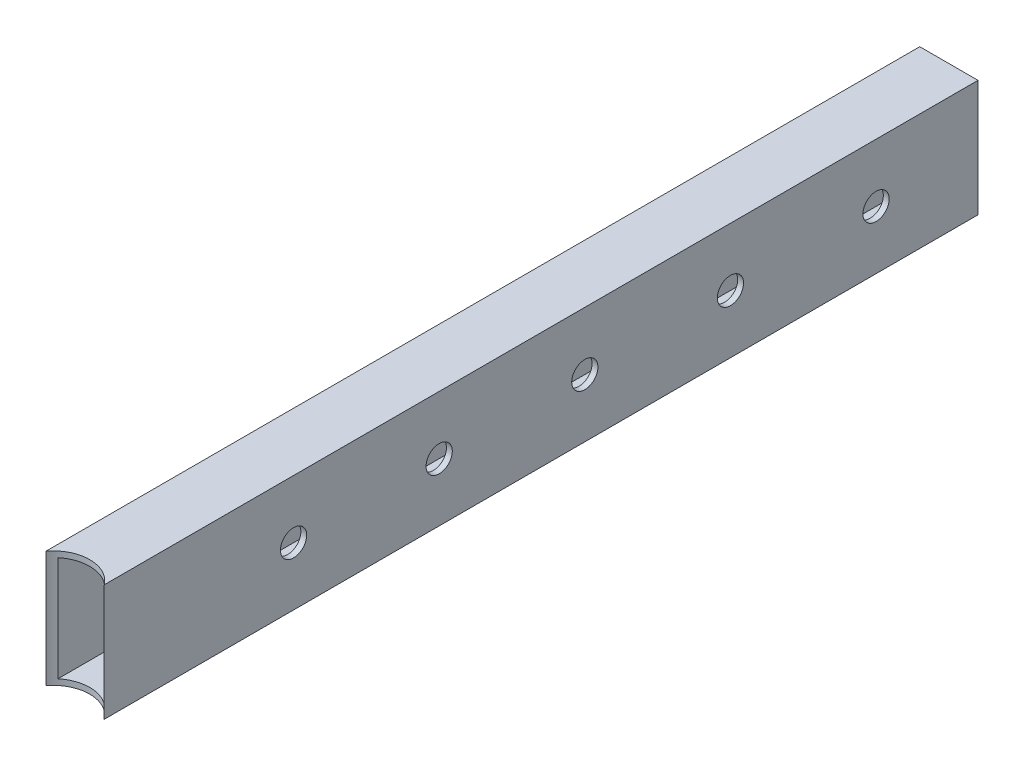
ISO-10303-21;
HEADER;
FILE_DESCRIPTION(('STEP AP214'),'2;1');
FILE_NAME('part.step','',(''),(''),'','','');
FILE_SCHEMA(('AUTOMOTIVE_DESIGN { 1 0 10303 214 1 1 1 1 }'));
ENDSEC;
DATA;
#1=APPLICATION_CONTEXT('core data for automotive mechanical design processes');
#2=APPLICATION_PROTOCOL_DEFINITION('international standard','automotive_design',2000,#1);
#3=PRODUCT_CONTEXT('',#1,'mechanical');
#4=PRODUCT('Part','Part','',(#3));
#5=PRODUCT_RELATED_PRODUCT_CATEGORY('part','',(#4));
#6=PRODUCT_DEFINITION_FORMATION('','',#4);
#7=PRODUCT_DEFINITION_CONTEXT('part definition',#1,'design');
#8=PRODUCT_DEFINITION('design','',#6,#7);
#9=PRODUCT_DEFINITION_SHAPE('','',#8);
#10=(LENGTH_UNIT() NAMED_UNIT(*) SI_UNIT(.MILLI.,.METRE.));
#11=(NAMED_UNIT(*) PLANE_ANGLE_UNIT() SI_UNIT($,.RADIAN.));
#12=(NAMED_UNIT(*) SI_UNIT($,.STERADIAN.) SOLID_ANGLE_UNIT());
#13=UNCERTAINTY_MEASURE_WITH_UNIT(LENGTH_MEASURE(1.E-05),#10,'distance_accuracy_value','');
#14=(GEOMETRIC_REPRESENTATION_CONTEXT(3) GLOBAL_UNCERTAINTY_ASSIGNED_CONTEXT((#13)) GLOBAL_UNIT_ASSIGNED_CONTEXT((#10,
#11,#12)) REPRESENTATION_CONTEXT('',''));
#15=CARTESIAN_POINT('',(0.,0.,0.));
#16=DIRECTION('',(0.,0.,1.));
#17=DIRECTION('',(1.,0.,0.));
#18=AXIS2_PLACEMENT_3D('',#15,#16,#17);
#19=CARTESIAN_POINT('',(0.,0.,0.));
#20=DIRECTION('',(0.,0.,1.));
#21=DIRECTION('',(1.,0.,0.));
#22=AXIS2_PLACEMENT_3D('',#19,#20,#21);
#23=PLANE('',#22);
#24=DIRECTION('',(0.,1.,0.));
#25=VECTOR('',#24,1.);
#26=CARTESIAN_POINT('',(9.99999999999999,20.,0.));
#27=LINE('',#26,#25);
#28=CARTESIAN_POINT('',(10.,-20.,0.));
#29=VERTEX_POINT('',#28);
#30=CARTESIAN_POINT('',(9.99999999999999,20.,0.));
#31=VERTEX_POINT('',#30);
#32=EDGE_CURVE('E132',#29,#31,#27,.T.);
#33=ORIENTED_EDGE('',*,*,#32,.F.);
#34=DIRECTION('',(1.,0.,0.));
#35=VECTOR('',#34,1.);
#36=CARTESIAN_POINT('',(-10.,-20.,0.));
#37=LINE('',#36,#35);
#38=CARTESIAN_POINT('',(-10.,-20.,0.));
#39=VERTEX_POINT('',#38);
#40=EDGE_CURVE('E116',#39,#29,#37,.T.);
#41=ORIENTED_EDGE('',*,*,#40,.F.);
#42=DIRECTION('',(0.,-1.,0.));
#43=VECTOR('',#42,1.);
#44=CARTESIAN_POINT('',(-10.,20.,0.));
#45=LINE('',#44,#43);
#46=CARTESIAN_POINT('',(-10.,20.,0.));
#47=VERTEX_POINT('',#46);
#48=EDGE_CURVE('E126',#47,#39,#45,.T.);
#49=ORIENTED_EDGE('',*,*,#48,.F.);
#50=DIRECTION('',(-1.,0.,0.));
#51=VECTOR('',#50,1.);
#52=CARTESIAN_POINT('',(-10.,20.,0.));
#53=LINE('',#52,#51);
#54=EDGE_CURVE('E134',#31,#47,#53,.T.);
#55=ORIENTED_EDGE('',*,*,#54,.F.);
#56=EDGE_LOOP('',(#33,#41,#49,#55));
#57=FACE_BOUND('',#56,.T.);
#58=DIRECTION('',(0.,1.,0.));
#59=VECTOR('',#58,1.);
#60=CARTESIAN_POINT('',(8.,18.,0.));
#61=LINE('',#60,#59);
#62=CARTESIAN_POINT('',(8.,-18.,0.));
#63=VERTEX_POINT('',#62);
#64=CARTESIAN_POINT('',(8.,18.,0.));
#65=VERTEX_POINT('',#64);
#66=EDGE_CURVE('E239',#63,#65,#61,.T.);
#67=ORIENTED_EDGE('',*,*,#66,.T.);
#68=DIRECTION('',(-1.,0.,0.));
#69=VECTOR('',#68,1.);
#70=CARTESIAN_POINT('',(-8.,18.,0.));
#71=LINE('',#70,#69);
#72=CARTESIAN_POINT('',(-8.,18.,0.));
#73=VERTEX_POINT('',#72);
#74=EDGE_CURVE('E242',#65,#73,#71,.T.);
#75=ORIENTED_EDGE('',*,*,#74,.T.);
#76=DIRECTION('',(0.,-1.,0.));
#77=VECTOR('',#76,1.);
#78=CARTESIAN_POINT('',(-8.,18.,0.));
#79=LINE('',#78,#77);
#80=CARTESIAN_POINT('',(-8.,-18.,0.));
#81=VERTEX_POINT('',#80);
#82=EDGE_CURVE('E245',#73,#81,#79,.T.);
#83=ORIENTED_EDGE('',*,*,#82,.T.);
#84=DIRECTION('',(1.,0.,0.));
#85=VECTOR('',#84,1.);
#86=CARTESIAN_POINT('',(-8.,-18.,0.));
#87=LINE('',#86,#85);
#88=EDGE_CURVE('E248',#81,#63,#87,.T.);
#89=ORIENTED_EDGE('',*,*,#88,.T.);
#90=EDGE_LOOP('',(#67,#75,#83,#89));
#91=FACE_BOUND('',#90,.T.);
#92=ADVANCED_FACE('F34',(#57,#91),#23,.F.);
#93=CARTESIAN_POINT('',(9.99999999999999,20.,300.));
#94=DIRECTION('',(-1.,0.,0.));
#95=DIRECTION('',(0.,-1.,0.));
#96=AXIS2_PLACEMENT_3D('',#93,#94,#95);
#97=PLANE('',#96);
#98=CARTESIAN_POINT('',(10.,0.,235.));
#99=DIRECTION('',(1.,0.,0.));
#100=DIRECTION('',(0.,1.,0.));
#101=AXIS2_PLACEMENT_3D('',#98,#99,#100);
#102=CIRCLE('',#101,4.50000000000002);
#103=CARTESIAN_POINT('',(10.,4.50000000000002,235.));
#104=VERTEX_POINT('',#103);
#105=EDGE_CURVE('E206',#104,#104,#102,.T.);
#106=ORIENTED_EDGE('',*,*,#105,.F.);
#107=EDGE_LOOP('',(#106));
#108=FACE_BOUND('',#107,.T.);
#109=CARTESIAN_POINT('',(10.,0.,185.));
#110=DIRECTION('',(1.,0.,0.));
#111=DIRECTION('',(0.,1.,0.));
#112=AXIS2_PLACEMENT_3D('',#109,#110,#111);
#113=CIRCLE('',#112,4.49999999999999);
#114=CARTESIAN_POINT('',(10.,4.49999999999999,185.));
#115=VERTEX_POINT('',#114);
#116=EDGE_CURVE('E208',#115,#115,#113,.T.);
#117=ORIENTED_EDGE('',*,*,#116,.F.);
#118=EDGE_LOOP('',(#117));
#119=FACE_BOUND('',#118,.T.);
#120=CARTESIAN_POINT('',(10.,0.,135.));
#121=DIRECTION('',(1.,0.,0.));
#122=DIRECTION('',(0.,1.,0.));
#123=AXIS2_PLACEMENT_3D('',#120,#121,#122);
#124=CIRCLE('',#123,4.49999999999999);
#125=CARTESIAN_POINT('',(10.,4.49999999999999,135.));
#126=VERTEX_POINT('',#125);
#127=EDGE_CURVE('E214',#126,#126,#124,.T.);
#128=ORIENTED_EDGE('',*,*,#127,.F.);
#129=EDGE_LOOP('',(#128));
#130=FACE_BOUND('',#129,.T.);
#131=CARTESIAN_POINT('',(10.,0.,85.));
#132=DIRECTION('',(1.,0.,0.));
#133=DIRECTION('',(0.,1.,0.));
#134=AXIS2_PLACEMENT_3D('',#131,#132,#133);
#135=CIRCLE('',#134,4.5);
#136=CARTESIAN_POINT('',(10.,4.5,85.));
#137=VERTEX_POINT('',#136);
#138=EDGE_CURVE('E220',#137,#137,#135,.T.);
#139=ORIENTED_EDGE('',*,*,#138,.F.);
#140=EDGE_LOOP('',(#139));
#141=FACE_BOUND('',#140,.T.);
#142=CARTESIAN_POINT('',(10.,0.,35.));
#143=DIRECTION('',(1.,0.,0.));
#144=DIRECTION('',(0.,1.,0.));
#145=AXIS2_PLACEMENT_3D('',#142,#143,#144);
#146=CIRCLE('',#145,4.5);
#147=CARTESIAN_POINT('',(10.,4.5,35.));
#148=VERTEX_POINT('',#147);
#149=EDGE_CURVE('E226',#148,#148,#146,.T.);
#150=ORIENTED_EDGE('',*,*,#149,.F.);
#151=EDGE_LOOP('',(#150));
#152=FACE_BOUND('',#151,.T.);
#153=ORIENTED_EDGE('',*,*,#32,.T.);
#154=DIRECTION('',(0.,0.,-1.));
#155=VECTOR('',#154,1.);
#156=CARTESIAN_POINT('',(9.99999999999999,20.,300.));
#157=LINE('',#156,#155);
#158=CARTESIAN_POINT('',(10.,20.,300.));
#159=VERTEX_POINT('',#158);
#160=EDGE_CURVE('E42',#159,#31,#157,.T.);
#161=ORIENTED_EDGE('',*,*,#160,.F.);
#162=DIRECTION('',(0.,1.,0.));
#163=VECTOR('',#162,1.);
#164=CARTESIAN_POINT('',(9.99999999999999,20.,300.));
#165=LINE('',#164,#163);
#166=CARTESIAN_POINT('',(10.,-20.,300.));
#167=VERTEX_POINT('',#166);
#168=EDGE_CURVE('E102',#167,#159,#165,.T.);
#169=ORIENTED_EDGE('',*,*,#168,.F.);
#170=DIRECTION('',(0.,0.,-1.));
#171=VECTOR('',#170,1.);
#172=CARTESIAN_POINT('',(10.,-20.,300.));
#173=LINE('',#172,#171);
#174=EDGE_CURVE('E113',#167,#29,#173,.T.);
#175=ORIENTED_EDGE('',*,*,#174,.T.);
#176=EDGE_LOOP('',(#153,#161,#169,#175));
#177=FACE_BOUND('',#176,.T.);
#178=ADVANCED_FACE('F36',(#108,#119,#130,#141,#152,#177),#97,.F.);
#179=CARTESIAN_POINT('',(-10.,20.,300.));
#180=DIRECTION('',(0.,-1.,0.));
#181=DIRECTION('',(0.,0.,-1.));
#182=AXIS2_PLACEMENT_3D('',#179,#180,#181);
#183=PLANE('',#182);
#184=DIRECTION('',(0.,0.,-1.));
#185=VECTOR('',#184,1.);
#186=CARTESIAN_POINT('',(-10.,20.,300.));
#187=LINE('',#186,#185);
#188=CARTESIAN_POINT('',(-10.,20.,300.));
#189=VERTEX_POINT('',#188);
#190=EDGE_CURVE('E138',#189,#47,#187,.T.);
#191=ORIENTED_EDGE('',*,*,#190,.F.);
#192=CARTESIAN_POINT('',(0.,20.,307.5));
#193=DIRECTION('',(0.,1.,0.));
#194=DIRECTION('',(0.,0.,1.));
#195=AXIS2_PLACEMENT_3D('',#192,#193,#194);
#196=CIRCLE('',#195,12.5);
#197=EDGE_CURVE('E110',#159,#189,#196,.T.);
#198=ORIENTED_EDGE('',*,*,#197,.F.);
#199=ORIENTED_EDGE('',*,*,#160,.T.);
#200=ORIENTED_EDGE('',*,*,#54,.T.);
#201=EDGE_LOOP('',(#191,#198,#199,#200));
#202=FACE_BOUND('',#201,.T.);
#203=ADVANCED_FACE('F142',(#202),#183,.F.);
#204=CARTESIAN_POINT('',(-10.,20.,300.));
#205=DIRECTION('',(1.,0.,0.));
#206=DIRECTION('',(0.,1.,0.));
#207=AXIS2_PLACEMENT_3D('',#204,#205,#206);
#208=PLANE('',#207);
#209=ORIENTED_EDGE('',*,*,#48,.T.);
#210=DIRECTION('',(0.,0.,-1.));
#211=VECTOR('',#210,1.);
#212=CARTESIAN_POINT('',(-10.,-20.,300.));
#213=LINE('',#212,#211);
#214=CARTESIAN_POINT('',(-10.,-20.,300.));
#215=VERTEX_POINT('',#214);
#216=EDGE_CURVE('E120',#215,#39,#213,.T.);
#217=ORIENTED_EDGE('',*,*,#216,.F.);
#218=DIRECTION('',(0.,-1.,0.));
#219=VECTOR('',#218,1.);
#220=CARTESIAN_POINT('',(-10.,20.,300.));
#221=LINE('',#220,#219);
#222=EDGE_CURVE('E105',#189,#215,#221,.T.);
#223=ORIENTED_EDGE('',*,*,#222,.F.);
#224=ORIENTED_EDGE('',*,*,#190,.T.);
#225=EDGE_LOOP('',(#209,#217,#223,#224));
#226=FACE_BOUND('',#225,.T.);
#227=ADVANCED_FACE('F147',(#226),#208,.F.);
#228=CARTESIAN_POINT('',(-10.,-20.,300.));
#229=DIRECTION('',(0.,1.,0.));
#230=DIRECTION('',(0.,0.,1.));
#231=AXIS2_PLACEMENT_3D('',#228,#229,#230);
#232=PLANE('',#231);
#233=ORIENTED_EDGE('',*,*,#174,.F.);
#234=CARTESIAN_POINT('',(0.,-20.,307.5));
#235=DIRECTION('',(0.,1.,0.));
#236=DIRECTION('',(0.,0.,1.));
#237=AXIS2_PLACEMENT_3D('',#234,#235,#236);
#238=CIRCLE('',#237,12.5);
#239=EDGE_CURVE('E98',#167,#215,#238,.T.);
#240=ORIENTED_EDGE('',*,*,#239,.T.);
#241=ORIENTED_EDGE('',*,*,#216,.T.);
#242=ORIENTED_EDGE('',*,*,#40,.T.);
#243=EDGE_LOOP('',(#233,#240,#241,#242));
#244=FACE_BOUND('',#243,.T.);
#245=ADVANCED_FACE('F114',(#244),#232,.F.);
#246=CARTESIAN_POINT('',(8.,18.,300.));
#247=DIRECTION('',(-1.,0.,0.));
#248=DIRECTION('',(0.,0.,1.));
#249=AXIS2_PLACEMENT_3D('',#246,#247,#248);
#250=PLANE('',#249);
#251=CARTESIAN_POINT('',(8.,0.,235.));
#252=DIRECTION('',(1.,0.,0.));
#253=DIRECTION('',(0.,1.,0.));
#254=AXIS2_PLACEMENT_3D('',#251,#252,#253);
#255=CIRCLE('',#254,4.50000000000002);
#256=CARTESIAN_POINT('',(8.,4.50000000000002,235.));
#257=VERTEX_POINT('',#256);
#258=EDGE_CURVE('E203',#257,#257,#255,.T.);
#259=ORIENTED_EDGE('',*,*,#258,.T.);
#260=EDGE_LOOP('',(#259));
#261=FACE_BOUND('',#260,.T.);
#262=CARTESIAN_POINT('',(8.,0.,185.));
#263=DIRECTION('',(1.,0.,0.));
#264=DIRECTION('',(0.,1.,0.));
#265=AXIS2_PLACEMENT_3D('',#262,#263,#264);
#266=CIRCLE('',#265,4.49999999999999);
#267=CARTESIAN_POINT('',(8.,4.49999999999999,185.));
#268=VERTEX_POINT('',#267);
#269=EDGE_CURVE('E211',#268,#268,#266,.T.);
#270=ORIENTED_EDGE('',*,*,#269,.T.);
#271=EDGE_LOOP('',(#270));
#272=FACE_BOUND('',#271,.T.);
#273=CARTESIAN_POINT('',(8.,0.,135.));
#274=DIRECTION('',(1.,0.,0.));
#275=DIRECTION('',(0.,1.,0.));
#276=AXIS2_PLACEMENT_3D('',#273,#274,#275);
#277=CIRCLE('',#276,4.49999999999999);
#278=CARTESIAN_POINT('',(8.,4.49999999999999,135.));
#279=VERTEX_POINT('',#278);
#280=EDGE_CURVE('E217',#279,#279,#277,.T.);
#281=ORIENTED_EDGE('',*,*,#280,.T.);
#282=EDGE_LOOP('',(#281));
#283=FACE_BOUND('',#282,.T.);
#284=CARTESIAN_POINT('',(8.,0.,85.));
#285=DIRECTION('',(1.,0.,0.));
#286=DIRECTION('',(0.,1.,0.));
#287=AXIS2_PLACEMENT_3D('',#284,#285,#286);
#288=CIRCLE('',#287,4.5);
#289=CARTESIAN_POINT('',(8.,4.5,85.));
#290=VERTEX_POINT('',#289);
#291=EDGE_CURVE('E223',#290,#290,#288,.T.);
#292=ORIENTED_EDGE('',*,*,#291,.T.);
#293=EDGE_LOOP('',(#292));
#294=FACE_BOUND('',#293,.T.);
#295=CARTESIAN_POINT('',(8.,0.,35.));
#296=DIRECTION('',(1.,0.,0.));
#297=DIRECTION('',(0.,1.,0.));
#298=AXIS2_PLACEMENT_3D('',#295,#296,#297);
#299=CIRCLE('',#298,4.5);
#300=CARTESIAN_POINT('',(8.,4.5,35.));
#301=VERTEX_POINT('',#300);
#302=EDGE_CURVE('E229',#301,#301,#299,.T.);
#303=ORIENTED_EDGE('',*,*,#302,.T.);
#304=EDGE_LOOP('',(#303));
#305=FACE_BOUND('',#304,.T.);
#306=DIRECTION('',(0.,1.,0.));
#307=VECTOR('',#306,1.);
#308=CARTESIAN_POINT('',(8.,-20.,297.895313643851));
#309=LINE('',#308,#307);
#310=CARTESIAN_POINT('',(8.,18.,297.895313643851));
#311=VERTEX_POINT('',#310);
#312=CARTESIAN_POINT('',(8.,-18.,297.895313643851));
#313=VERTEX_POINT('',#312);
#314=EDGE_CURVE('E48',#311,#313,#309,.F.);
#315=ORIENTED_EDGE('',*,*,#314,.F.);
#316=DIRECTION('',(0.,0.,-1.));
#317=VECTOR('',#316,1.);
#318=CARTESIAN_POINT('',(8.,18.,300.));
#319=LINE('',#318,#317);
#320=EDGE_CURVE('E129',#311,#65,#319,.T.);
#321=ORIENTED_EDGE('',*,*,#320,.T.);
#322=ORIENTED_EDGE('',*,*,#66,.F.);
#323=DIRECTION('',(0.,0.,-1.));
#324=VECTOR('',#323,1.);
#325=CARTESIAN_POINT('',(8.,-18.,300.));
#326=LINE('',#325,#324);
#327=EDGE_CURVE('E55',#313,#63,#326,.T.);
#328=ORIENTED_EDGE('',*,*,#327,.F.);
#329=EDGE_LOOP('',(#315,#321,#322,#328));
#330=FACE_BOUND('',#329,.T.);
#331=ADVANCED_FACE('F154',(#261,#272,#283,#294,#305,#330),#250,.T.);
#332=CARTESIAN_POINT('',(-8.,18.,300.));
#333=DIRECTION('',(0.,-1.,0.));
#334=DIRECTION('',(0.,0.,-1.));
#335=AXIS2_PLACEMENT_3D('',#332,#333,#334);
#336=PLANE('',#335);
#337=CARTESIAN_POINT('',(0.,18.,307.5));
#338=DIRECTION('',(0.,-1.,0.));
#339=DIRECTION('',(0.,0.,-1.));
#340=AXIS2_PLACEMENT_3D('',#337,#338,#339);
#341=CIRCLE('',#340,12.5);
#342=CARTESIAN_POINT('',(-8.,18.,297.895313643851));
#343=VERTEX_POINT('',#342);
#344=EDGE_CURVE('E236',#343,#311,#341,.T.);
#345=ORIENTED_EDGE('',*,*,#344,.F.);
#346=DIRECTION('',(0.,0.,-1.));
#347=VECTOR('',#346,1.);
#348=CARTESIAN_POINT('',(-8.,18.,300.));
#349=LINE('',#348,#347);
#350=EDGE_CURVE('E253',#343,#73,#349,.T.);
#351=ORIENTED_EDGE('',*,*,#350,.T.);
#352=ORIENTED_EDGE('',*,*,#74,.F.);
#353=ORIENTED_EDGE('',*,*,#320,.F.);
#354=EDGE_LOOP('',(#345,#351,#352,#353));
#355=FACE_BOUND('',#354,.T.);
#356=ADVANCED_FACE('F165',(#355),#336,.T.);
#357=CARTESIAN_POINT('',(-8.,18.,300.));
#358=DIRECTION('',(1.,0.,0.));
#359=DIRECTION('',(0.,0.,-1.));
#360=AXIS2_PLACEMENT_3D('',#357,#358,#359);
#361=PLANE('',#360);
#362=DIRECTION('',(0.,1.,0.));
#363=VECTOR('',#362,1.);
#364=CARTESIAN_POINT('',(-8.,-20.,297.895313643851));
#365=LINE('',#364,#363);
#366=CARTESIAN_POINT('',(-8.,-18.,297.895313643851));
#367=VERTEX_POINT('',#366);
#368=EDGE_CURVE('E109',#367,#343,#365,.T.);
#369=ORIENTED_EDGE('',*,*,#368,.F.);
#370=DIRECTION('',(0.,0.,-1.));
#371=VECTOR('',#370,1.);
#372=CARTESIAN_POINT('',(-8.,-18.,300.));
#373=LINE('',#372,#371);
#374=EDGE_CURVE('E252',#367,#81,#373,.T.);
#375=ORIENTED_EDGE('',*,*,#374,.T.);
#376=ORIENTED_EDGE('',*,*,#82,.F.);
#377=ORIENTED_EDGE('',*,*,#350,.F.);
#378=EDGE_LOOP('',(#369,#375,#376,#377));
#379=FACE_BOUND('',#378,.T.);
#380=ADVANCED_FACE('F169',(#379),#361,.T.);
#381=CARTESIAN_POINT('',(-8.,-18.,300.));
#382=DIRECTION('',(0.,1.,0.));
#383=DIRECTION('',(0.,0.,1.));
#384=AXIS2_PLACEMENT_3D('',#381,#382,#383);
#385=PLANE('',#384);
#386=CARTESIAN_POINT('',(0.,-18.,307.5));
#387=DIRECTION('',(0.,1.,0.));
#388=DIRECTION('',(0.,0.,1.));
#389=AXIS2_PLACEMENT_3D('',#386,#387,#388);
#390=CIRCLE('',#389,12.5);
#391=EDGE_CURVE('E11',#313,#367,#390,.T.);
#392=ORIENTED_EDGE('',*,*,#391,.F.);
#393=ORIENTED_EDGE('',*,*,#327,.T.);
#394=ORIENTED_EDGE('',*,*,#88,.F.);
#395=ORIENTED_EDGE('',*,*,#374,.F.);
#396=EDGE_LOOP('',(#392,#393,#394,#395));
#397=FACE_BOUND('',#396,.T.);
#398=ADVANCED_FACE('F173',(#397),#385,.T.);
#399=CARTESIAN_POINT('',(0.,-20.,307.5));
#400=DIRECTION('',(0.,1.,0.));
#401=DIRECTION('',(0.,0.,1.));
#402=AXIS2_PLACEMENT_3D('',#399,#400,#401);
#403=CYLINDRICAL_SURFACE('',#402,12.5);
#404=ORIENTED_EDGE('',*,*,#314,.T.);
#405=ORIENTED_EDGE('',*,*,#391,.T.);
#406=ORIENTED_EDGE('',*,*,#368,.T.);
#407=ORIENTED_EDGE('',*,*,#344,.T.);
#408=EDGE_LOOP('',(#404,#405,#406,#407));
#409=FACE_BOUND('',#408,.T.);
#410=ORIENTED_EDGE('',*,*,#197,.T.);
#411=ORIENTED_EDGE('',*,*,#222,.T.);
#412=ORIENTED_EDGE('',*,*,#239,.F.);
#413=ORIENTED_EDGE('',*,*,#168,.T.);
#414=EDGE_LOOP('',(#410,#411,#412,#413));
#415=FACE_BOUND('',#414,.T.);
#416=ADVANCED_FACE('F100',(#409,#415),#403,.F.);
#417=CARTESIAN_POINT('',(8.,0.,35.));
#418=DIRECTION('',(1.,0.,0.));
#419=DIRECTION('',(0.,1.,0.));
#420=AXIS2_PLACEMENT_3D('',#417,#418,#419);
#421=CYLINDRICAL_SURFACE('',#420,4.5);
#422=ORIENTED_EDGE('',*,*,#302,.F.);
#423=EDGE_LOOP('',(#422));
#424=FACE_BOUND('',#423,.T.);
#425=ORIENTED_EDGE('',*,*,#149,.T.);
#426=EDGE_LOOP('',(#425));
#427=FACE_BOUND('',#426,.T.);
#428=ADVANCED_FACE('F179',(#424,#427),#421,.F.);
#429=CARTESIAN_POINT('',(8.,0.,85.));
#430=DIRECTION('',(1.,0.,0.));
#431=DIRECTION('',(0.,1.,0.));
#432=AXIS2_PLACEMENT_3D('',#429,#430,#431);
#433=CYLINDRICAL_SURFACE('',#432,4.5);
#434=ORIENTED_EDGE('',*,*,#291,.F.);
#435=EDGE_LOOP('',(#434));
#436=FACE_BOUND('',#435,.T.);
#437=ORIENTED_EDGE('',*,*,#138,.T.);
#438=EDGE_LOOP('',(#437));
#439=FACE_BOUND('',#438,.T.);
#440=ADVANCED_FACE('F182',(#436,#439),#433,.F.);
#441=CARTESIAN_POINT('',(8.,0.,135.));
#442=DIRECTION('',(1.,0.,0.));
#443=DIRECTION('',(0.,1.,0.));
#444=AXIS2_PLACEMENT_3D('',#441,#442,#443);
#445=CYLINDRICAL_SURFACE('',#444,4.49999999999999);
#446=ORIENTED_EDGE('',*,*,#280,.F.);
#447=EDGE_LOOP('',(#446));
#448=FACE_BOUND('',#447,.T.);
#449=ORIENTED_EDGE('',*,*,#127,.T.);
#450=EDGE_LOOP('',(#449));
#451=FACE_BOUND('',#450,.T.);
#452=ADVANCED_FACE('F186',(#448,#451),#445,.F.);
#453=CARTESIAN_POINT('',(8.,0.,185.));
#454=DIRECTION('',(1.,0.,0.));
#455=DIRECTION('',(0.,1.,0.));
#456=AXIS2_PLACEMENT_3D('',#453,#454,#455);
#457=CYLINDRICAL_SURFACE('',#456,4.49999999999999);
#458=ORIENTED_EDGE('',*,*,#269,.F.);
#459=EDGE_LOOP('',(#458));
#460=FACE_BOUND('',#459,.T.);
#461=ORIENTED_EDGE('',*,*,#116,.T.);
#462=EDGE_LOOP('',(#461));
#463=FACE_BOUND('',#462,.T.);
#464=ADVANCED_FACE('F190',(#460,#463),#457,.F.);
#465=CARTESIAN_POINT('',(8.,0.,235.));
#466=DIRECTION('',(1.,0.,0.));
#467=DIRECTION('',(0.,1.,0.));
#468=AXIS2_PLACEMENT_3D('',#465,#466,#467);
#469=CYLINDRICAL_SURFACE('',#468,4.50000000000002);
#470=ORIENTED_EDGE('',*,*,#258,.F.);
#471=EDGE_LOOP('',(#470));
#472=FACE_BOUND('',#471,.T.);
#473=ORIENTED_EDGE('',*,*,#105,.T.);
#474=EDGE_LOOP('',(#473));
#475=FACE_BOUND('',#474,.T.);
#476=ADVANCED_FACE('F194',(#472,#475),#469,.F.);
#477=CLOSED_SHELL('',(#92,#178,#203,#227,#245,#331,#356,#380,#398,#416,#428,#440,#452,#464,#476));
#478=MANIFOLD_SOLID_BREP('B2',#477);
#479=ADVANCED_BREP_SHAPE_REPRESENTATION('',(#18,#478),#14);
#480=SHAPE_DEFINITION_REPRESENTATION(#9,#479);
ENDSEC;
END-ISO-10303-21;
